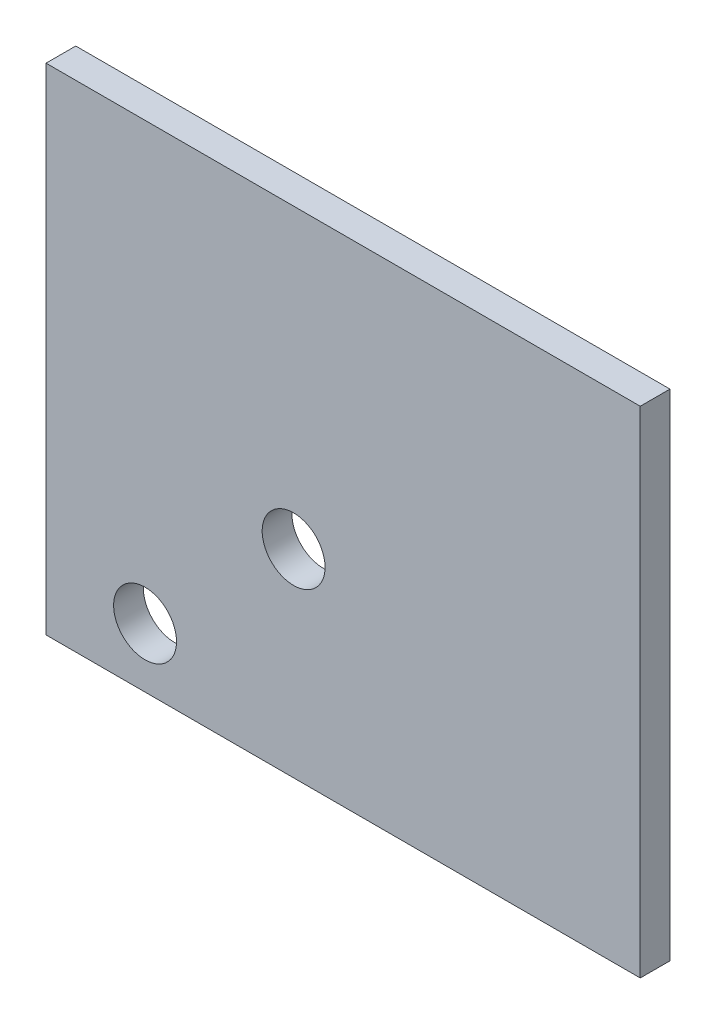
ISO-10303-21;
HEADER;
FILE_DESCRIPTION(('STEP AP214'),'2;1');
FILE_NAME('part.step','',(''),(''),'','','');
FILE_SCHEMA(('AUTOMOTIVE_DESIGN { 1 0 10303 214 1 1 1 1 }'));
ENDSEC;
DATA;
#1=APPLICATION_CONTEXT('core data for automotive mechanical design processes');
#2=APPLICATION_PROTOCOL_DEFINITION('international standard','automotive_design',2000,#1);
#3=PRODUCT_CONTEXT('',#1,'mechanical');
#4=PRODUCT('Part','Part','',(#3));
#5=PRODUCT_RELATED_PRODUCT_CATEGORY('part','',(#4));
#6=PRODUCT_DEFINITION_FORMATION('','',#4);
#7=PRODUCT_DEFINITION_CONTEXT('part definition',#1,'design');
#8=PRODUCT_DEFINITION('design','',#6,#7);
#9=PRODUCT_DEFINITION_SHAPE('','',#8);
#10=(LENGTH_UNIT() NAMED_UNIT(*) SI_UNIT(.MILLI.,.METRE.));
#11=(NAMED_UNIT(*) PLANE_ANGLE_UNIT() SI_UNIT($,.RADIAN.));
#12=(NAMED_UNIT(*) SI_UNIT($,.STERADIAN.) SOLID_ANGLE_UNIT());
#13=UNCERTAINTY_MEASURE_WITH_UNIT(LENGTH_MEASURE(1.E-05),#10,'distance_accuracy_value','');
#14=(GEOMETRIC_REPRESENTATION_CONTEXT(3) GLOBAL_UNCERTAINTY_ASSIGNED_CONTEXT((#13)) GLOBAL_UNIT_ASSIGNED_CONTEXT((#10,
#11,#12)) REPRESENTATION_CONTEXT('',''));
#15=CARTESIAN_POINT('',(0.,0.,0.));
#16=DIRECTION('',(0.,0.,1.));
#17=DIRECTION('',(1.,0.,0.));
#18=AXIS2_PLACEMENT_3D('',#15,#16,#17);
#19=CARTESIAN_POINT('',(0.,0.,3.));
#20=DIRECTION('',(1.,0.,0.));
#21=DIRECTION('',(0.,1.,0.));
#22=AXIS2_PLACEMENT_3D('',#19,#20,#21);
#23=PLANE('',#22);
#24=DIRECTION('',(0.,-1.,0.));
#25=VECTOR('',#24,1.);
#26=CARTESIAN_POINT('',(0.,0.,0.));
#27=LINE('',#26,#25);
#28=CARTESIAN_POINT('',(0.,0.,0.));
#29=VERTEX_POINT('',#28);
#30=CARTESIAN_POINT('',(0.,-50.,0.));
#31=VERTEX_POINT('',#30);
#32=EDGE_CURVE('E105',#29,#31,#27,.T.);
#33=ORIENTED_EDGE('',*,*,#32,.T.);
#34=DIRECTION('',(0.,0.,-1.));
#35=VECTOR('',#34,1.);
#36=CARTESIAN_POINT('',(0.,-50.,3.));
#37=LINE('',#36,#35);
#38=CARTESIAN_POINT('',(0.,-50.,3.));
#39=VERTEX_POINT('',#38);
#40=EDGE_CURVE('E11',#39,#31,#37,.T.);
#41=ORIENTED_EDGE('',*,*,#40,.F.);
#42=DIRECTION('',(0.,-1.,0.));
#43=VECTOR('',#42,1.);
#44=CARTESIAN_POINT('',(0.,0.,3.));
#45=LINE('',#44,#43);
#46=CARTESIAN_POINT('',(0.,0.,3.));
#47=VERTEX_POINT('',#46);
#48=EDGE_CURVE('E89',#47,#39,#45,.T.);
#49=ORIENTED_EDGE('',*,*,#48,.F.);
#50=DIRECTION('',(0.,0.,-1.));
#51=VECTOR('',#50,1.);
#52=CARTESIAN_POINT('',(0.,0.,3.));
#53=LINE('',#52,#51);
#54=EDGE_CURVE('E98',#47,#29,#53,.T.);
#55=ORIENTED_EDGE('',*,*,#54,.T.);
#56=EDGE_LOOP('',(#33,#41,#49,#55));
#57=FACE_BOUND('',#56,.T.);
#58=ADVANCED_FACE('F39',(#57),#23,.F.);
#59=CARTESIAN_POINT('',(0.,-50.,3.));
#60=DIRECTION('',(0.,1.,0.));
#61=DIRECTION('',(0.,0.,1.));
#62=AXIS2_PLACEMENT_3D('',#59,#60,#61);
#63=PLANE('',#62);
#64=DIRECTION('',(1.,0.,0.));
#65=VECTOR('',#64,1.);
#66=CARTESIAN_POINT('',(0.,-50.,0.));
#67=LINE('',#66,#65);
#68=CARTESIAN_POINT('',(60.,-50.,0.));
#69=VERTEX_POINT('',#68);
#70=EDGE_CURVE('E94',#31,#69,#67,.T.);
#71=ORIENTED_EDGE('',*,*,#70,.T.);
#72=DIRECTION('',(0.,0.,-1.));
#73=VECTOR('',#72,1.);
#74=CARTESIAN_POINT('',(60.,-50.,3.));
#75=LINE('',#74,#73);
#76=CARTESIAN_POINT('',(60.,-50.,3.));
#77=VERTEX_POINT('',#76);
#78=EDGE_CURVE('E50',#77,#69,#75,.T.);
#79=ORIENTED_EDGE('',*,*,#78,.F.);
#80=DIRECTION('',(1.,0.,0.));
#81=VECTOR('',#80,1.);
#82=CARTESIAN_POINT('',(0.,-50.,3.));
#83=LINE('',#82,#81);
#84=EDGE_CURVE('E84',#39,#77,#83,.T.);
#85=ORIENTED_EDGE('',*,*,#84,.F.);
#86=ORIENTED_EDGE('',*,*,#40,.T.);
#87=EDGE_LOOP('',(#71,#79,#85,#86));
#88=FACE_BOUND('',#87,.T.);
#89=ADVANCED_FACE('F91',(#88),#63,.F.);
#90=CARTESIAN_POINT('',(60.,0.,3.));
#91=DIRECTION('',(-1.,0.,0.));
#92=DIRECTION('',(0.,-1.,0.));
#93=AXIS2_PLACEMENT_3D('',#90,#91,#92);
#94=PLANE('',#93);
#95=DIRECTION('',(0.,1.,0.));
#96=VECTOR('',#95,1.);
#97=CARTESIAN_POINT('',(60.,0.,0.));
#98=LINE('',#97,#96);
#99=CARTESIAN_POINT('',(60.,0.,0.));
#100=VERTEX_POINT('',#99);
#101=EDGE_CURVE('E75',#69,#100,#98,.T.);
#102=ORIENTED_EDGE('',*,*,#101,.T.);
#103=DIRECTION('',(0.,0.,-1.));
#104=VECTOR('',#103,1.);
#105=CARTESIAN_POINT('',(60.,0.,3.));
#106=LINE('',#105,#104);
#107=CARTESIAN_POINT('',(60.,0.,3.));
#108=VERTEX_POINT('',#107);
#109=EDGE_CURVE('E92',#108,#100,#106,.T.);
#110=ORIENTED_EDGE('',*,*,#109,.F.);
#111=DIRECTION('',(0.,1.,0.));
#112=VECTOR('',#111,1.);
#113=CARTESIAN_POINT('',(60.,0.,3.));
#114=LINE('',#113,#112);
#115=EDGE_CURVE('E86',#77,#108,#114,.T.);
#116=ORIENTED_EDGE('',*,*,#115,.F.);
#117=ORIENTED_EDGE('',*,*,#78,.T.);
#118=EDGE_LOOP('',(#102,#110,#116,#117));
#119=FACE_BOUND('',#118,.T.);
#120=ADVANCED_FACE('F96',(#119),#94,.F.);
#121=CARTESIAN_POINT('',(0.,0.,3.));
#122=DIRECTION('',(0.,-1.,0.));
#123=DIRECTION('',(0.,0.,-1.));
#124=AXIS2_PLACEMENT_3D('',#121,#122,#123);
#125=PLANE('',#124);
#126=DIRECTION('',(-1.,0.,0.));
#127=VECTOR('',#126,1.);
#128=CARTESIAN_POINT('',(0.,0.,0.));
#129=LINE('',#128,#127);
#130=EDGE_CURVE('E78',#100,#29,#129,.T.);
#131=ORIENTED_EDGE('',*,*,#130,.T.);
#132=ORIENTED_EDGE('',*,*,#54,.F.);
#133=DIRECTION('',(-1.,0.,0.));
#134=VECTOR('',#133,1.);
#135=CARTESIAN_POINT('',(0.,0.,3.));
#136=LINE('',#135,#134);
#137=EDGE_CURVE('E54',#108,#47,#136,.T.);
#138=ORIENTED_EDGE('',*,*,#137,.F.);
#139=ORIENTED_EDGE('',*,*,#109,.T.);
#140=EDGE_LOOP('',(#131,#132,#138,#139));
#141=FACE_BOUND('',#140,.T.);
#142=ADVANCED_FACE('F109',(#141),#125,.F.);
#143=CARTESIAN_POINT('',(0.,0.,3.));
#144=DIRECTION('',(0.,0.,1.));
#145=DIRECTION('',(1.,0.,0.));
#146=AXIS2_PLACEMENT_3D('',#143,#144,#145);
#147=PLANE('',#146);
#148=CARTESIAN_POINT('',(25.,-30.,3.));
#149=DIRECTION('',(0.,0.,1.));
#150=DIRECTION('',(1.,0.,0.));
#151=AXIS2_PLACEMENT_3D('',#148,#149,#150);
#152=CIRCLE('',#151,3.175);
#153=CARTESIAN_POINT('',(28.175,-30.,3.));
#154=VERTEX_POINT('',#153);
#155=EDGE_CURVE('E125',#154,#154,#152,.T.);
#156=ORIENTED_EDGE('',*,*,#155,.F.);
#157=EDGE_LOOP('',(#156));
#158=FACE_BOUND('',#157,.T.);
#159=CARTESIAN_POINT('',(10.,-44.,3.));
#160=DIRECTION('',(0.,0.,1.));
#161=DIRECTION('',(1.,0.,0.));
#162=AXIS2_PLACEMENT_3D('',#159,#160,#161);
#163=CIRCLE('',#162,3.175);
#164=CARTESIAN_POINT('',(13.175,-44.,3.));
#165=VERTEX_POINT('',#164);
#166=EDGE_CURVE('E119',#165,#165,#163,.T.);
#167=ORIENTED_EDGE('',*,*,#166,.F.);
#168=EDGE_LOOP('',(#167));
#169=FACE_BOUND('',#168,.T.);
#170=ORIENTED_EDGE('',*,*,#48,.T.);
#171=ORIENTED_EDGE('',*,*,#84,.T.);
#172=ORIENTED_EDGE('',*,*,#115,.T.);
#173=ORIENTED_EDGE('',*,*,#137,.T.);
#174=EDGE_LOOP('',(#170,#171,#172,#173));
#175=FACE_BOUND('',#174,.T.);
#176=ADVANCED_FACE('F88',(#158,#169,#175),#147,.T.);
#177=CARTESIAN_POINT('',(0.,0.,0.));
#178=DIRECTION('',(0.,0.,1.));
#179=DIRECTION('',(1.,0.,0.));
#180=AXIS2_PLACEMENT_3D('',#177,#178,#179);
#181=PLANE('',#180);
#182=CARTESIAN_POINT('',(25.,-30.,0.));
#183=DIRECTION('',(0.,0.,1.));
#184=DIRECTION('',(1.,0.,0.));
#185=AXIS2_PLACEMENT_3D('',#182,#183,#184);
#186=CIRCLE('',#185,3.175);
#187=CARTESIAN_POINT('',(28.175,-30.,0.));
#188=VERTEX_POINT('',#187);
#189=EDGE_CURVE('E104',#188,#188,#186,.T.);
#190=ORIENTED_EDGE('',*,*,#189,.T.);
#191=EDGE_LOOP('',(#190));
#192=FACE_BOUND('',#191,.T.);
#193=CARTESIAN_POINT('',(10.,-44.,0.));
#194=DIRECTION('',(0.,0.,1.));
#195=DIRECTION('',(1.,0.,0.));
#196=AXIS2_PLACEMENT_3D('',#193,#194,#195);
#197=CIRCLE('',#196,3.175);
#198=CARTESIAN_POINT('',(13.175,-44.,0.));
#199=VERTEX_POINT('',#198);
#200=EDGE_CURVE('E117',#199,#199,#197,.T.);
#201=ORIENTED_EDGE('',*,*,#200,.T.);
#202=EDGE_LOOP('',(#201));
#203=FACE_BOUND('',#202,.T.);
#204=ORIENTED_EDGE('',*,*,#32,.F.);
#205=ORIENTED_EDGE('',*,*,#130,.F.);
#206=ORIENTED_EDGE('',*,*,#101,.F.);
#207=ORIENTED_EDGE('',*,*,#70,.F.);
#208=EDGE_LOOP('',(#204,#205,#206,#207));
#209=FACE_BOUND('',#208,.T.);
#210=ADVANCED_FACE('F114',(#192,#203,#209),#181,.F.);
#211=CARTESIAN_POINT('',(10.,-44.,0.));
#212=DIRECTION('',(0.,0.,1.));
#213=DIRECTION('',(1.,0.,0.));
#214=AXIS2_PLACEMENT_3D('',#211,#212,#213);
#215=CYLINDRICAL_SURFACE('',#214,3.175);
#216=ORIENTED_EDGE('',*,*,#200,.F.);
#217=EDGE_LOOP('',(#216));
#218=FACE_BOUND('',#217,.T.);
#219=ORIENTED_EDGE('',*,*,#166,.T.);
#220=EDGE_LOOP('',(#219));
#221=FACE_BOUND('',#220,.T.);
#222=ADVANCED_FACE('F133',(#218,#221),#215,.F.);
#223=CARTESIAN_POINT('',(25.,-30.,0.));
#224=DIRECTION('',(0.,0.,1.));
#225=DIRECTION('',(1.,0.,0.));
#226=AXIS2_PLACEMENT_3D('',#223,#224,#225);
#227=CYLINDRICAL_SURFACE('',#226,3.175);
#228=ORIENTED_EDGE('',*,*,#189,.F.);
#229=EDGE_LOOP('',(#228));
#230=FACE_BOUND('',#229,.T.);
#231=ORIENTED_EDGE('',*,*,#155,.T.);
#232=EDGE_LOOP('',(#231));
#233=FACE_BOUND('',#232,.T.);
#234=ADVANCED_FACE('F128',(#230,#233),#227,.F.);
#235=CLOSED_SHELL('',(#58,#89,#120,#142,#176,#210,#222,#234));
#236=MANIFOLD_SOLID_BREP('B2',#235);
#237=ADVANCED_BREP_SHAPE_REPRESENTATION('',(#18,#236),#14);
#238=SHAPE_DEFINITION_REPRESENTATION(#9,#237);
ENDSEC;
END-ISO-10303-21;
